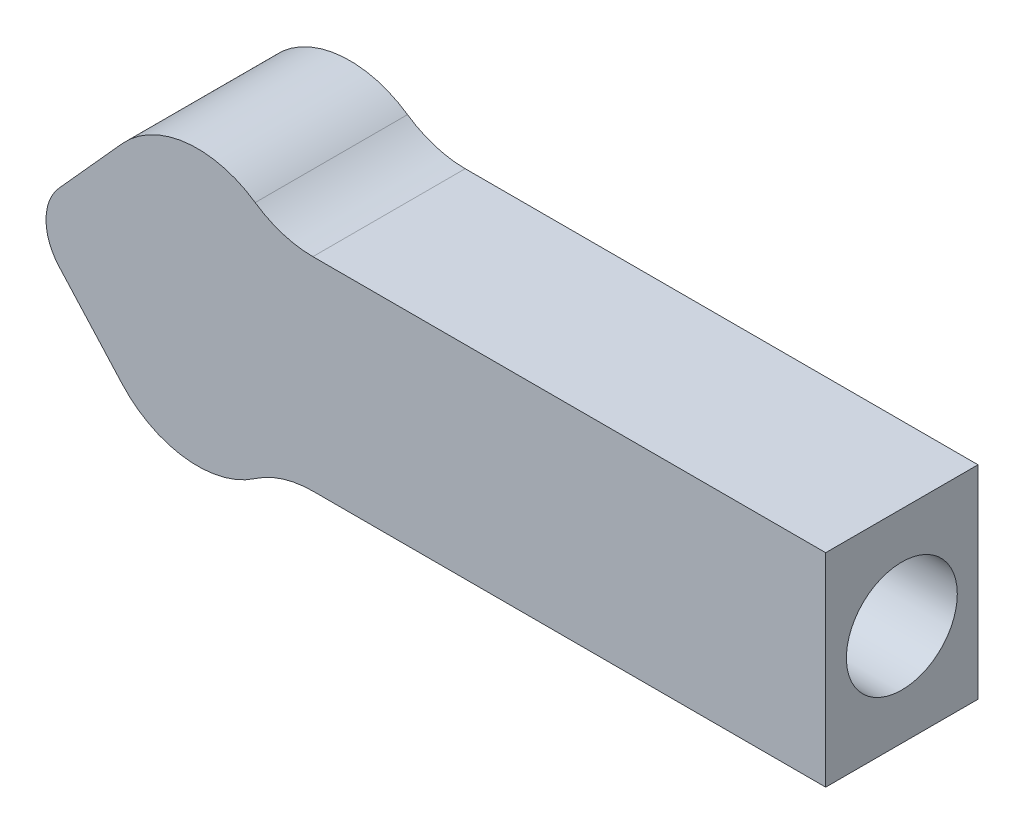
ISO-10303-21;
HEADER;
FILE_DESCRIPTION(('STEP AP214'),'2;1');
FILE_NAME('part.step','',(''),(''),'','','');
FILE_SCHEMA(('AUTOMOTIVE_DESIGN { 1 0 10303 214 1 1 1 1 }'));
ENDSEC;
DATA;
#1=APPLICATION_CONTEXT('core data for automotive mechanical design processes');
#2=APPLICATION_PROTOCOL_DEFINITION('international standard','automotive_design',2000,#1);
#3=PRODUCT_CONTEXT('',#1,'mechanical');
#4=PRODUCT('Part','Part','',(#3));
#5=PRODUCT_RELATED_PRODUCT_CATEGORY('part','',(#4));
#6=PRODUCT_DEFINITION_FORMATION('','',#4);
#7=PRODUCT_DEFINITION_CONTEXT('part definition',#1,'design');
#8=PRODUCT_DEFINITION('design','',#6,#7);
#9=PRODUCT_DEFINITION_SHAPE('','',#8);
#10=(LENGTH_UNIT() NAMED_UNIT(*) SI_UNIT(.MILLI.,.METRE.));
#11=(NAMED_UNIT(*) PLANE_ANGLE_UNIT() SI_UNIT($,.RADIAN.));
#12=(NAMED_UNIT(*) SI_UNIT($,.STERADIAN.) SOLID_ANGLE_UNIT());
#13=UNCERTAINTY_MEASURE_WITH_UNIT(LENGTH_MEASURE(1.E-05),#10,'distance_accuracy_value','');
#14=(GEOMETRIC_REPRESENTATION_CONTEXT(3) GLOBAL_UNCERTAINTY_ASSIGNED_CONTEXT((#13)) GLOBAL_UNIT_ASSIGNED_CONTEXT((#10,
#11,#12)) REPRESENTATION_CONTEXT('',''));
#15=CARTESIAN_POINT('',(0.,0.,0.));
#16=DIRECTION('',(0.,0.,1.));
#17=DIRECTION('',(1.,0.,0.));
#18=AXIS2_PLACEMENT_3D('',#15,#16,#17);
#19=CARTESIAN_POINT('',(-3.673024490945,3.3082873485211,3.));
#20=DIRECTION('',(0.743036049611687,-0.66925139445313,0.));
#21=DIRECTION('',(0.66925139445313,0.743036049611687,0.));
#22=AXIS2_PLACEMENT_3D('',#19,#20,#21);
#23=PLANE('',#22);
#24=DIRECTION('',(-0.66925139445313,-0.743036049611687,0.));
#25=VECTOR('',#24,1.);
#26=CARTESIAN_POINT('',(-3.673024490945,3.3082873485211,3.));
#27=LINE('',#26,#25);
#28=CARTESIAN_POINT('',(-4.80902328071808,2.0470452202079,3.));
#29=VERTEX_POINT('',#28);
#30=CARTESIAN_POINT('',(-6.04999999999998,0.66925139445313,3.));
#31=VERTEX_POINT('',#30);
#32=EDGE_CURVE('E131',#29,#31,#27,.T.);
#33=ORIENTED_EDGE('',*,*,#32,.F.);
#34=DIRECTION('',(0.,0.,-1.));
#35=VECTOR('',#34,1.);
#36=CARTESIAN_POINT('',(-4.80902328071808,2.0470452202079,3.));
#37=LINE('',#36,#35);
#38=CARTESIAN_POINT('',(-4.80902328071808,2.0470452202079,0.));
#39=VERTEX_POINT('',#38);
#40=EDGE_CURVE('E42',#29,#39,#37,.T.);
#41=ORIENTED_EDGE('',*,*,#40,.T.);
#42=DIRECTION('',(-0.66925139445313,-0.743036049611687,0.));
#43=VECTOR('',#42,1.);
#44=CARTESIAN_POINT('',(-3.673024490945,3.3082873485211,0.));
#45=LINE('',#44,#43);
#46=CARTESIAN_POINT('',(-6.04999999999998,0.66925139445313,0.));
#47=VERTEX_POINT('',#46);
#48=EDGE_CURVE('E121',#39,#47,#45,.T.);
#49=ORIENTED_EDGE('',*,*,#48,.T.);
#50=DIRECTION('',(0.,0.,-1.));
#51=VECTOR('',#50,1.);
#52=CARTESIAN_POINT('',(-6.04999999999998,0.66925139445313,3.));
#53=LINE('',#52,#51);
#54=EDGE_CURVE('E166',#31,#47,#53,.T.);
#55=ORIENTED_EDGE('',*,*,#54,.F.);
#56=EDGE_LOOP('',(#33,#41,#49,#55));
#57=FACE_BOUND('',#56,.T.);
#58=ADVANCED_FACE('F34',(#57),#23,.F.);
#59=CARTESIAN_POINT('',(-5.30696395038829,0.,3.));
#60=DIRECTION('',(0.,0.,-1.));
#61=DIRECTION('',(-1.,0.,0.));
#62=AXIS2_PLACEMENT_3D('',#59,#60,#61);
#63=CYLINDRICAL_SURFACE('',#62,1.);
#64=CARTESIAN_POINT('',(-5.30696395038829,0.,0.));
#65=DIRECTION('',(0.,0.,1.));
#66=DIRECTION('',(1.,0.,0.));
#67=AXIS2_PLACEMENT_3D('',#64,#65,#66);
#68=CIRCLE('',#67,1.);
#69=CARTESIAN_POINT('',(-6.04999999999998,-0.66925139445313,0.));
#70=VERTEX_POINT('',#69);
#71=EDGE_CURVE('E124',#47,#70,#68,.T.);
#72=ORIENTED_EDGE('',*,*,#71,.T.);
#73=DIRECTION('',(0.,0.,-1.));
#74=VECTOR('',#73,1.);
#75=CARTESIAN_POINT('',(-6.04999999999998,-0.66925139445313,3.));
#76=LINE('',#75,#74);
#77=CARTESIAN_POINT('',(-6.04999999999998,-0.66925139445313,3.));
#78=VERTEX_POINT('',#77);
#79=EDGE_CURVE('E163',#78,#70,#76,.T.);
#80=ORIENTED_EDGE('',*,*,#79,.F.);
#81=CARTESIAN_POINT('',(-5.30696395038829,0.,3.));
#82=DIRECTION('',(0.,0.,1.));
#83=DIRECTION('',(1.,0.,0.));
#84=AXIS2_PLACEMENT_3D('',#81,#82,#83);
#85=CIRCLE('',#84,1.);
#86=EDGE_CURVE('E133',#31,#78,#85,.T.);
#87=ORIENTED_EDGE('',*,*,#86,.F.);
#88=ORIENTED_EDGE('',*,*,#54,.T.);
#89=EDGE_LOOP('',(#72,#80,#87,#88));
#90=FACE_BOUND('',#89,.T.);
#91=ADVANCED_FACE('F207',(#90),#63,.T.);
#92=CARTESIAN_POINT('',(-3.673024490945,-3.3082873485211,3.));
#93=DIRECTION('',(0.743036049611687,0.66925139445313,0.));
#94=DIRECTION('',(-0.66925139445313,0.743036049611687,0.));
#95=AXIS2_PLACEMENT_3D('',#92,#93,#94);
#96=PLANE('',#95);
#97=DIRECTION('',(0.66925139445313,-0.743036049611687,0.));
#98=VECTOR('',#97,1.);
#99=CARTESIAN_POINT('',(-3.673024490945,-3.3082873485211,0.));
#100=LINE('',#99,#98);
#101=CARTESIAN_POINT('',(-4.80902328071808,-2.0470452202079,0.));
#102=VERTEX_POINT('',#101);
#103=EDGE_CURVE('E149',#70,#102,#100,.T.);
#104=ORIENTED_EDGE('',*,*,#103,.T.);
#105=DIRECTION('',(0.,0.,1.));
#106=VECTOR('',#105,1.);
#107=CARTESIAN_POINT('',(-4.80902328071808,-2.0470452202079,3.));
#108=LINE('',#107,#106);
#109=CARTESIAN_POINT('',(-4.80902328071808,-2.0470452202079,3.));
#110=VERTEX_POINT('',#109);
#111=EDGE_CURVE('E190',#102,#110,#108,.T.);
#112=ORIENTED_EDGE('',*,*,#111,.T.);
#113=DIRECTION('',(0.66925139445313,-0.743036049611687,0.));
#114=VECTOR('',#113,1.);
#115=CARTESIAN_POINT('',(-3.673024490945,-3.3082873485211,3.));
#116=LINE('',#115,#114);
#117=EDGE_CURVE('E136',#78,#110,#116,.T.);
#118=ORIENTED_EDGE('',*,*,#117,.F.);
#119=ORIENTED_EDGE('',*,*,#79,.T.);
#120=EDGE_LOOP('',(#104,#112,#118,#119));
#121=FACE_BOUND('',#120,.T.);
#122=ADVANCED_FACE('F248',(#121),#96,.F.);
#123=CARTESIAN_POINT('',(0.,-2.,3.));
#124=DIRECTION('',(0.,-1.,0.));
#125=DIRECTION('',(0.,0.,-1.));
#126=AXIS2_PLACEMENT_3D('',#123,#124,#125);
#127=PLANE('',#126);
#128=DIRECTION('',(-1.,0.,0.));
#129=VECTOR('',#128,1.);
#130=CARTESIAN_POINT('',(0.,-2.,3.));
#131=LINE('',#130,#129);
#132=CARTESIAN_POINT('',(9.04999999999998,-2.,3.));
#133=VERTEX_POINT('',#132);
#134=CARTESIAN_POINT('',(-1.04999999999998,-2.,3.));
#135=VERTEX_POINT('',#134);
#136=EDGE_CURVE('E139',#133,#135,#131,.T.);
#137=ORIENTED_EDGE('',*,*,#136,.T.);
#138=DIRECTION('',(0.,0.,-1.));
#139=VECTOR('',#138,1.);
#140=CARTESIAN_POINT('',(-1.04999999999998,-2.,0.));
#141=LINE('',#140,#139);
#142=CARTESIAN_POINT('',(-1.04999999999998,-2.,0.));
#143=VERTEX_POINT('',#142);
#144=EDGE_CURVE('E169',#135,#143,#141,.T.);
#145=ORIENTED_EDGE('',*,*,#144,.T.);
#146=DIRECTION('',(-1.,0.,0.));
#147=VECTOR('',#146,1.);
#148=CARTESIAN_POINT('',(0.,-2.,0.));
#149=LINE('',#148,#147);
#150=CARTESIAN_POINT('',(9.04999999999998,-2.,0.));
#151=VERTEX_POINT('',#150);
#152=EDGE_CURVE('E152',#151,#143,#149,.T.);
#153=ORIENTED_EDGE('',*,*,#152,.F.);
#154=DIRECTION('',(0.,0.,-1.));
#155=VECTOR('',#154,1.);
#156=CARTESIAN_POINT('',(9.04999999999998,-2.,3.));
#157=LINE('',#156,#155);
#158=EDGE_CURVE('E161',#133,#151,#157,.T.);
#159=ORIENTED_EDGE('',*,*,#158,.F.);
#160=EDGE_LOOP('',(#137,#145,#153,#159));
#161=FACE_BOUND('',#160,.T.);
#162=ADVANCED_FACE('F223',(#161),#127,.T.);
#163=CARTESIAN_POINT('',(9.04999999999998,0.,3.));
#164=DIRECTION('',(1.,0.,0.));
#165=DIRECTION('',(0.,0.,-1.));
#166=AXIS2_PLACEMENT_3D('',#163,#164,#165);
#167=PLANE('',#166);
#168=CARTESIAN_POINT('',(9.04999999999998,0.,1.5));
#169=DIRECTION('',(1.,0.,0.));
#170=DIRECTION('',(0.,0.,-1.));
#171=AXIS2_PLACEMENT_3D('',#168,#169,#170);
#172=CIRCLE('',#171,1.0922);
#173=CARTESIAN_POINT('',(9.04999999999998,0.,0.4078));
#174=VERTEX_POINT('',#173);
#175=EDGE_CURVE('E127',#174,#174,#172,.T.);
#176=ORIENTED_EDGE('',*,*,#175,.F.);
#177=EDGE_LOOP('',(#176));
#178=FACE_BOUND('',#177,.T.);
#179=DIRECTION('',(0.,-1.,0.));
#180=VECTOR('',#179,1.);
#181=CARTESIAN_POINT('',(9.04999999999998,0.,0.));
#182=LINE('',#181,#180);
#183=CARTESIAN_POINT('',(9.04999999999998,2.,0.));
#184=VERTEX_POINT('',#183);
#185=EDGE_CURVE('E155',#184,#151,#182,.T.);
#186=ORIENTED_EDGE('',*,*,#185,.F.);
#187=DIRECTION('',(0.,0.,-1.));
#188=VECTOR('',#187,1.);
#189=CARTESIAN_POINT('',(9.04999999999998,2.,3.));
#190=LINE('',#189,#188);
#191=CARTESIAN_POINT('',(9.04999999999998,2.,3.));
#192=VERTEX_POINT('',#191);
#193=EDGE_CURVE('E146',#192,#184,#190,.T.);
#194=ORIENTED_EDGE('',*,*,#193,.F.);
#195=DIRECTION('',(0.,-1.,0.));
#196=VECTOR('',#195,1.);
#197=CARTESIAN_POINT('',(9.04999999999998,0.,3.));
#198=LINE('',#197,#196);
#199=EDGE_CURVE('E142',#192,#133,#198,.T.);
#200=ORIENTED_EDGE('',*,*,#199,.T.);
#201=ORIENTED_EDGE('',*,*,#158,.T.);
#202=EDGE_LOOP('',(#186,#194,#200,#201));
#203=FACE_BOUND('',#202,.T.);
#204=ADVANCED_FACE('F229',(#178,#203),#167,.T.);
#205=CARTESIAN_POINT('',(0.,2.,3.));
#206=DIRECTION('',(0.,1.,0.));
#207=DIRECTION('',(0.,0.,1.));
#208=AXIS2_PLACEMENT_3D('',#205,#206,#207);
#209=PLANE('',#208);
#210=DIRECTION('',(1.,0.,0.));
#211=VECTOR('',#210,1.);
#212=CARTESIAN_POINT('',(0.,2.,0.));
#213=LINE('',#212,#211);
#214=CARTESIAN_POINT('',(-1.04999999999998,2.,0.));
#215=VERTEX_POINT('',#214);
#216=EDGE_CURVE('E134',#215,#184,#213,.T.);
#217=ORIENTED_EDGE('',*,*,#216,.F.);
#218=DIRECTION('',(0.,0.,-1.));
#219=VECTOR('',#218,1.);
#220=CARTESIAN_POINT('',(-1.04999999999998,2.,3.));
#221=LINE('',#220,#219);
#222=CARTESIAN_POINT('',(-1.04999999999998,2.,3.));
#223=VERTEX_POINT('',#222);
#224=EDGE_CURVE('E172',#215,#223,#221,.F.);
#225=ORIENTED_EDGE('',*,*,#224,.T.);
#226=DIRECTION('',(1.,0.,0.));
#227=VECTOR('',#226,1.);
#228=CARTESIAN_POINT('',(0.,2.,3.));
#229=LINE('',#228,#227);
#230=EDGE_CURVE('E145',#223,#192,#229,.T.);
#231=ORIENTED_EDGE('',*,*,#230,.T.);
#232=ORIENTED_EDGE('',*,*,#193,.T.);
#233=EDGE_LOOP('',(#217,#225,#231,#232));
#234=FACE_BOUND('',#233,.T.);
#235=ADVANCED_FACE('F232',(#234),#209,.T.);
#236=CARTESIAN_POINT('',(0.,0.,3.));
#237=DIRECTION('',(0.,0.,1.));
#238=DIRECTION('',(1.,0.,0.));
#239=AXIS2_PLACEMENT_3D('',#236,#237,#238);
#240=PLANE('',#239);
#241=ORIENTED_EDGE('',*,*,#117,.T.);
#242=CARTESIAN_POINT('',(-3.32295118149471,-0.708542431301642,3.));
#243=DIRECTION('',(0.,0.,1.));
#244=DIRECTION('',(1.,0.,0.));
#245=AXIS2_PLACEMENT_3D('',#242,#243,#244);
#246=CIRCLE('',#245,2.);
#247=CARTESIAN_POINT('',(-2.18647559074734,-2.35427121565082,3.));
#248=VERTEX_POINT('',#247);
#249=EDGE_CURVE('E193',#110,#248,#246,.T.);
#250=ORIENTED_EDGE('',*,*,#249,.T.);
#251=CARTESIAN_POINT('',(-1.04999999999998,-4.,3.));
#252=DIRECTION('',(0.,0.,1.));
#253=DIRECTION('',(1.,0.,0.));
#254=AXIS2_PLACEMENT_3D('',#251,#252,#253);
#255=CIRCLE('',#254,2.);
#256=EDGE_CURVE('E177',#248,#135,#255,.F.);
#257=ORIENTED_EDGE('',*,*,#256,.T.);
#258=ORIENTED_EDGE('',*,*,#136,.F.);
#259=ORIENTED_EDGE('',*,*,#199,.F.);
#260=ORIENTED_EDGE('',*,*,#230,.F.);
#261=CARTESIAN_POINT('',(-1.04999999999998,4.,3.));
#262=DIRECTION('',(0.,0.,1.));
#263=DIRECTION('',(1.,0.,0.));
#264=AXIS2_PLACEMENT_3D('',#261,#262,#263);
#265=CIRCLE('',#264,2.);
#266=CARTESIAN_POINT('',(-2.18647559074734,2.35427121565082,3.));
#267=VERTEX_POINT('',#266);
#268=EDGE_CURVE('E181',#223,#267,#265,.F.);
#269=ORIENTED_EDGE('',*,*,#268,.T.);
#270=CARTESIAN_POINT('',(-3.32295118149471,0.708542431301642,3.));
#271=DIRECTION('',(0.,0.,1.));
#272=DIRECTION('',(1.,0.,0.));
#273=AXIS2_PLACEMENT_3D('',#270,#271,#272);
#274=CIRCLE('',#273,2.);
#275=EDGE_CURVE('E54',#267,#29,#274,.T.);
#276=ORIENTED_EDGE('',*,*,#275,.T.);
#277=ORIENTED_EDGE('',*,*,#32,.T.);
#278=ORIENTED_EDGE('',*,*,#86,.T.);
#279=EDGE_LOOP('',(#241,#250,#257,#258,#259,#260,#269,#276,#277,#278));
#280=FACE_BOUND('',#279,.T.);
#281=ADVANCED_FACE('F209',(#280),#240,.T.);
#282=CARTESIAN_POINT('',(0.,0.,0.));
#283=DIRECTION('',(0.,0.,1.));
#284=DIRECTION('',(1.,0.,0.));
#285=AXIS2_PLACEMENT_3D('',#282,#283,#284);
#286=PLANE('',#285);
#287=CARTESIAN_POINT('',(-1.04999999999998,-4.,0.));
#288=DIRECTION('',(0.,0.,1.));
#289=DIRECTION('',(1.,0.,0.));
#290=AXIS2_PLACEMENT_3D('',#287,#288,#289);
#291=CIRCLE('',#290,2.);
#292=CARTESIAN_POINT('',(-2.18647559074734,-2.35427121565082,0.));
#293=VERTEX_POINT('',#292);
#294=EDGE_CURVE('E174',#143,#293,#291,.T.);
#295=ORIENTED_EDGE('',*,*,#294,.T.);
#296=CARTESIAN_POINT('',(-3.32295118149471,-0.708542431301642,0.));
#297=DIRECTION('',(0.,0.,1.));
#298=DIRECTION('',(1.,0.,0.));
#299=AXIS2_PLACEMENT_3D('',#296,#297,#298);
#300=CIRCLE('',#299,2.);
#301=EDGE_CURVE('E188',#293,#102,#300,.F.);
#302=ORIENTED_EDGE('',*,*,#301,.T.);
#303=ORIENTED_EDGE('',*,*,#103,.F.);
#304=ORIENTED_EDGE('',*,*,#71,.F.);
#305=ORIENTED_EDGE('',*,*,#48,.F.);
#306=CARTESIAN_POINT('',(-3.32295118149471,0.708542431301642,0.));
#307=DIRECTION('',(0.,0.,1.));
#308=DIRECTION('',(1.,0.,0.));
#309=AXIS2_PLACEMENT_3D('',#306,#307,#308);
#310=CIRCLE('',#309,2.);
#311=CARTESIAN_POINT('',(-2.18647559074734,2.35427121565082,0.));
#312=VERTEX_POINT('',#311);
#313=EDGE_CURVE('E186',#39,#312,#310,.F.);
#314=ORIENTED_EDGE('',*,*,#313,.T.);
#315=CARTESIAN_POINT('',(-1.04999999999998,4.,0.));
#316=DIRECTION('',(0.,0.,1.));
#317=DIRECTION('',(1.,0.,0.));
#318=AXIS2_PLACEMENT_3D('',#315,#316,#317);
#319=CIRCLE('',#318,2.);
#320=EDGE_CURVE('E179',#312,#215,#319,.T.);
#321=ORIENTED_EDGE('',*,*,#320,.T.);
#322=ORIENTED_EDGE('',*,*,#216,.T.);
#323=ORIENTED_EDGE('',*,*,#185,.T.);
#324=ORIENTED_EDGE('',*,*,#152,.T.);
#325=EDGE_LOOP('',(#295,#302,#303,#304,#305,#314,#321,#322,#323,#324));
#326=FACE_BOUND('',#325,.T.);
#327=ADVANCED_FACE('F202',(#326),#286,.F.);
#328=CARTESIAN_POINT('',(-1.04999999999998,-4.,3.));
#329=DIRECTION('',(0.,0.,1.));
#330=DIRECTION('',(1.,0.,0.));
#331=AXIS2_PLACEMENT_3D('',#328,#329,#330);
#332=CYLINDRICAL_SURFACE('',#331,2.);
#333=ORIENTED_EDGE('',*,*,#256,.F.);
#334=DIRECTION('',(0.,0.,1.));
#335=VECTOR('',#334,1.);
#336=CARTESIAN_POINT('',(-2.18647559074734,-2.35427121565082,3.));
#337=LINE('',#336,#335);
#338=EDGE_CURVE('E183',#248,#293,#337,.F.);
#339=ORIENTED_EDGE('',*,*,#338,.T.);
#340=ORIENTED_EDGE('',*,*,#294,.F.);
#341=ORIENTED_EDGE('',*,*,#144,.F.);
#342=EDGE_LOOP('',(#333,#339,#340,#341));
#343=FACE_BOUND('',#342,.T.);
#344=ADVANCED_FACE('F218',(#343),#332,.F.);
#345=CARTESIAN_POINT('',(-1.04999999999998,4.,3.));
#346=DIRECTION('',(0.,0.,-1.));
#347=DIRECTION('',(-1.,0.,0.));
#348=AXIS2_PLACEMENT_3D('',#345,#346,#347);
#349=CYLINDRICAL_SURFACE('',#348,2.);
#350=ORIENTED_EDGE('',*,*,#320,.F.);
#351=DIRECTION('',(0.,0.,-1.));
#352=VECTOR('',#351,1.);
#353=CARTESIAN_POINT('',(-2.18647559074734,2.35427121565082,3.));
#354=LINE('',#353,#352);
#355=EDGE_CURVE('E11',#312,#267,#354,.F.);
#356=ORIENTED_EDGE('',*,*,#355,.T.);
#357=ORIENTED_EDGE('',*,*,#268,.F.);
#358=ORIENTED_EDGE('',*,*,#224,.F.);
#359=EDGE_LOOP('',(#350,#356,#357,#358));
#360=FACE_BOUND('',#359,.T.);
#361=ADVANCED_FACE('F234',(#360),#349,.F.);
#362=CARTESIAN_POINT('',(-3.32295118149471,-0.708542431301642,3.));
#363=DIRECTION('',(0.,0.,1.));
#364=DIRECTION('',(1.,0.,0.));
#365=AXIS2_PLACEMENT_3D('',#362,#363,#364);
#366=CYLINDRICAL_SURFACE('',#365,2.);
#367=ORIENTED_EDGE('',*,*,#249,.F.);
#368=ORIENTED_EDGE('',*,*,#111,.F.);
#369=ORIENTED_EDGE('',*,*,#301,.F.);
#370=ORIENTED_EDGE('',*,*,#338,.F.);
#371=EDGE_LOOP('',(#367,#368,#369,#370));
#372=FACE_BOUND('',#371,.T.);
#373=ADVANCED_FACE('F216',(#372),#366,.T.);
#374=CARTESIAN_POINT('',(-3.32295118149471,0.708542431301642,3.));
#375=DIRECTION('',(0.,0.,-1.));
#376=DIRECTION('',(-1.,0.,0.));
#377=AXIS2_PLACEMENT_3D('',#374,#375,#376);
#378=CYLINDRICAL_SURFACE('',#377,2.);
#379=ORIENTED_EDGE('',*,*,#275,.F.);
#380=ORIENTED_EDGE('',*,*,#355,.F.);
#381=ORIENTED_EDGE('',*,*,#313,.F.);
#382=ORIENTED_EDGE('',*,*,#40,.F.);
#383=EDGE_LOOP('',(#379,#380,#381,#382));
#384=FACE_BOUND('',#383,.T.);
#385=ADVANCED_FACE('F36',(#384),#378,.T.);
#386=CARTESIAN_POINT('',(6.04999999999998,0.,1.5));
#387=DIRECTION('',(1.,0.,0.));
#388=DIRECTION('',(0.,0.,-1.));
#389=AXIS2_PLACEMENT_3D('',#386,#387,#388);
#390=PLANE('',#389);
#391=CARTESIAN_POINT('',(6.04999999999998,0.,1.5));
#392=DIRECTION('',(1.,0.,0.));
#393=DIRECTION('',(0.,0.,-1.));
#394=AXIS2_PLACEMENT_3D('',#391,#392,#393);
#395=CIRCLE('',#394,1.0922);
#396=CARTESIAN_POINT('',(6.04999999999998,0.,0.4078));
#397=VERTEX_POINT('',#396);
#398=EDGE_CURVE('E122',#397,#397,#395,.T.);
#399=ORIENTED_EDGE('',*,*,#398,.T.);
#400=EDGE_LOOP('',(#399));
#401=FACE_BOUND('',#400,.T.);
#402=CARTESIAN_POINT('',(6.04999999999998,0.,1.5));
#403=DIRECTION('',(1.,0.,0.));
#404=DIRECTION('',(0.,0.,-1.));
#405=AXIS2_PLACEMENT_3D('',#402,#403,#404);
#406=CIRCLE('',#405,0.624999999999999);
#407=CARTESIAN_POINT('',(6.04999999999998,0.,0.875000000000001));
#408=VERTEX_POINT('',#407);
#409=EDGE_CURVE('E119',#408,#408,#406,.F.);
#410=ORIENTED_EDGE('',*,*,#409,.T.);
#411=EDGE_LOOP('',(#410));
#412=FACE_BOUND('',#411,.T.);
#413=ADVANCED_FACE('F236',(#401,#412),#390,.T.);
#414=CARTESIAN_POINT('',(6.04999999999998,0.,1.5));
#415=DIRECTION('',(1.,0.,0.));
#416=DIRECTION('',(0.,0.,-1.));
#417=AXIS2_PLACEMENT_3D('',#414,#415,#416);
#418=CYLINDRICAL_SURFACE('',#417,1.0922);
#419=ORIENTED_EDGE('',*,*,#398,.F.);
#420=EDGE_LOOP('',(#419));
#421=FACE_BOUND('',#420,.T.);
#422=ORIENTED_EDGE('',*,*,#175,.T.);
#423=EDGE_LOOP('',(#422));
#424=FACE_BOUND('',#423,.T.);
#425=ADVANCED_FACE('F115',(#421,#424),#418,.F.);
#426=CARTESIAN_POINT('',(6.04999999999998,0.,1.5));
#427=DIRECTION('',(1.,0.,0.));
#428=DIRECTION('',(0.,0.,-1.));
#429=AXIS2_PLACEMENT_3D('',#426,#427,#428);
#430=CONICAL_SURFACE('',#429,0.624999999999999,1.02974425867665);
#431=CARTESIAN_POINT('',(5.67446211310775,0.,1.5));
#432=VERTEX_POINT('',#431);
#433=VERTEX_LOOP('',#432);
#434=FACE_BOUND('',#433,.T.);
#435=ORIENTED_EDGE('',*,*,#409,.F.);
#436=EDGE_LOOP('',(#435));
#437=FACE_BOUND('',#436,.T.);
#438=ADVANCED_FACE('F112',(#434,#437),#430,.F.);
#439=CLOSED_SHELL('',(#58,#91,#122,#162,#204,#235,#281,#327,#344,#361,#373,#385,#413,#425,#438));
#440=MANIFOLD_SOLID_BREP('B2',#439);
#441=ADVANCED_BREP_SHAPE_REPRESENTATION('',(#18,#440),#14);
#442=SHAPE_DEFINITION_REPRESENTATION(#9,#441);
ENDSEC;
END-ISO-10303-21;
